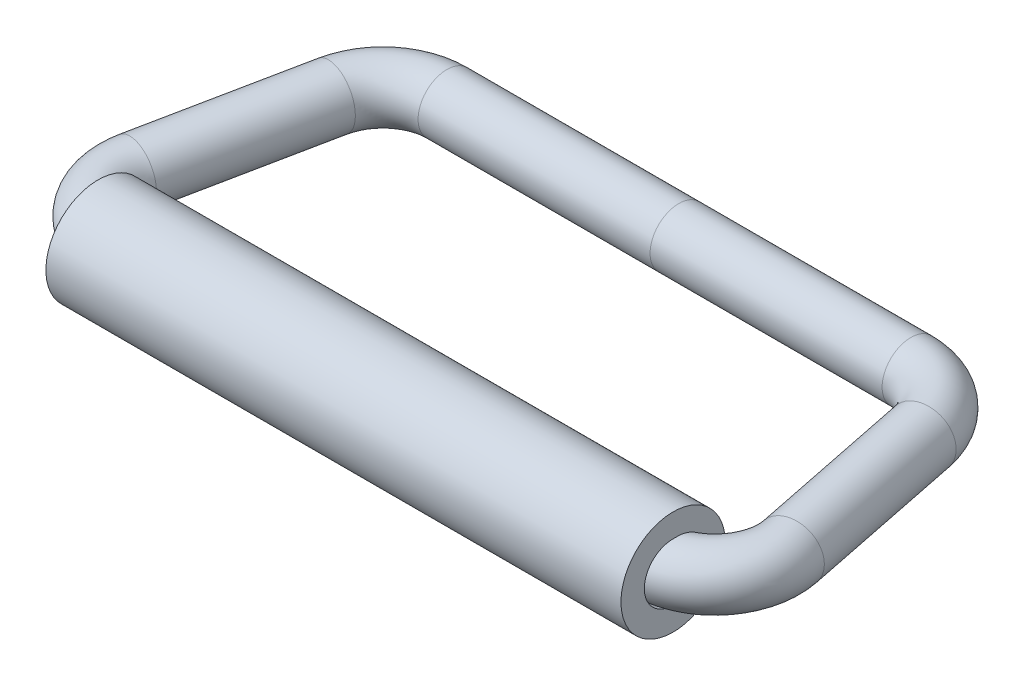
ISO-10303-21;
HEADER;
FILE_DESCRIPTION(('STEP AP214'),'2;1');
FILE_NAME('part.step','',(''),(''),'','','');
FILE_SCHEMA(('AUTOMOTIVE_DESIGN { 1 0 10303 214 1 1 1 1 }'));
ENDSEC;
DATA;
#1=APPLICATION_CONTEXT('core data for automotive mechanical design processes');
#2=APPLICATION_PROTOCOL_DEFINITION('international standard','automotive_design',2000,#1);
#3=PRODUCT_CONTEXT('',#1,'mechanical');
#4=PRODUCT('Part','Part','',(#3));
#5=PRODUCT_RELATED_PRODUCT_CATEGORY('part','',(#4));
#6=PRODUCT_DEFINITION_FORMATION('','',#4);
#7=PRODUCT_DEFINITION_CONTEXT('part definition',#1,'design');
#8=PRODUCT_DEFINITION('design','',#6,#7);
#9=PRODUCT_DEFINITION_SHAPE('','',#8);
#10=(LENGTH_UNIT() NAMED_UNIT(*) SI_UNIT(.MILLI.,.METRE.));
#11=(NAMED_UNIT(*) PLANE_ANGLE_UNIT() SI_UNIT($,.RADIAN.));
#12=(NAMED_UNIT(*) SI_UNIT($,.STERADIAN.) SOLID_ANGLE_UNIT());
#13=UNCERTAINTY_MEASURE_WITH_UNIT(LENGTH_MEASURE(1.E-05),#10,'distance_accuracy_value','');
#14=(GEOMETRIC_REPRESENTATION_CONTEXT(3) GLOBAL_UNCERTAINTY_ASSIGNED_CONTEXT((#13)) GLOBAL_UNIT_ASSIGNED_CONTEXT((#10,
#11,#12)) REPRESENTATION_CONTEXT('',''));
#15=CARTESIAN_POINT('',(0.,0.,0.));
#16=DIRECTION('',(0.,0.,1.));
#17=DIRECTION('',(1.,0.,0.));
#18=AXIS2_PLACEMENT_3D('',#15,#16,#17);
#19=CARTESIAN_POINT('',(-32.276557201779,0.,-20.4));
#20=DIRECTION('',(1.,0.,0.));
#21=DIRECTION('',(0.,0.,-1.));
#22=AXIS2_PLACEMENT_3D('',#19,#20,#21);
#23=CYLINDRICAL_SURFACE('',#22,4.);
#24=CARTESIAN_POINT('',(-32.276557201779,0.,-20.4));
#25=DIRECTION('',(1.,0.,0.));
#26=DIRECTION('',(0.,0.,-1.));
#27=AXIS2_PLACEMENT_3D('',#24,#25,#26);
#28=CIRCLE('',#27,4.);
#29=CARTESIAN_POINT('',(-32.276557201779,0.,-24.4));
#30=VERTEX_POINT('',#29);
#31=EDGE_CURVE('E98',#30,#30,#28,.T.);
#32=ORIENTED_EDGE('',*,*,#31,.T.);
#33=EDGE_LOOP('',(#32));
#34=FACE_BOUND('',#33,.T.);
#35=CARTESIAN_POINT('',(0.,0.,-20.4));
#36=DIRECTION('',(1.,0.,0.));
#37=DIRECTION('',(0.,0.,-1.));
#38=AXIS2_PLACEMENT_3D('',#35,#36,#37);
#39=CIRCLE('',#38,4.);
#40=CARTESIAN_POINT('',(0.,0.,-24.4));
#41=VERTEX_POINT('',#40);
#42=EDGE_CURVE('E95',#41,#41,#39,.T.);
#43=ORIENTED_EDGE('',*,*,#42,.F.);
#44=EDGE_LOOP('',(#43));
#45=FACE_BOUND('',#44,.T.);
#46=ADVANCED_FACE('F38',(#34,#45),#23,.T.);
#47=CARTESIAN_POINT('',(-32.276557201779,0.,-11.5));
#48=DIRECTION('',(0.,-1.,0.));
#49=DIRECTION('',(0.,0.,-1.));
#50=AXIS2_PLACEMENT_3D('',#47,#48,#49);
#51=TOROIDAL_SURFACE('',#50,8.90000000000001,4.);
#52=CARTESIAN_POINT('',(-40.9991621981761,0.,-13.2680956073778));
#53=DIRECTION('',(0.198662427795257,0.,-0.980067977123268));
#54=DIRECTION('',(-0.980067977123268,0.,-0.198662427795257));
#55=AXIS2_PLACEMENT_3D('',#52,#53,#54);
#56=CIRCLE('',#55,4.);
#57=CARTESIAN_POINT('',(-44.9194341066692,0.,-14.0627453185588));
#58=VERTEX_POINT('',#57);
#59=EDGE_CURVE('E185',#58,#58,#56,.T.);
#60=CARTESIAN_POINT('',(-32.276557201779,0.,-11.5));
#61=DIRECTION('',(0.,-1.,0.));
#62=DIRECTION('',(0.,0.,-1.));
#63=AXIS2_PLACEMENT_3D('',#60,#61,#62);
#64=CIRCLE('',#63,12.9);
#65=EDGE_CURVE('',#58,#30,#64,.T.);
#66=ORIENTED_EDGE('',*,*,#59,.T.);
#67=ORIENTED_EDGE('',*,*,#31,.F.);
#68=ORIENTED_EDGE('',*,*,#65,.T.);
#69=ORIENTED_EDGE('',*,*,#65,.F.);
#70=EDGE_LOOP('',(#66,#68,#67,#69));
#71=FACE_BOUND('',#70,.T.);
#72=ADVANCED_FACE('F206',(#71),#51,.T.);
#73=CARTESIAN_POINT('',(-45.6613243603382,0.,9.73190439262221));
#74=DIRECTION('',(0.198662427795257,0.,-0.980067977123268));
#75=DIRECTION('',(-0.980067977123268,0.,-0.198662427795257));
#76=AXIS2_PLACEMENT_3D('',#73,#74,#75);
#77=CYLINDRICAL_SURFACE('',#76,4.);
#78=CARTESIAN_POINT('',(-45.6613243603382,0.,9.73190439262221));
#79=DIRECTION('',(0.198662427795257,0.,-0.980067977123268));
#80=DIRECTION('',(-0.980067977123268,0.,-0.198662427795257));
#81=AXIS2_PLACEMENT_3D('',#78,#79,#80);
#82=CIRCLE('',#81,4.);
#83=CARTESIAN_POINT('',(-49.5815962688313,0.,8.93725468144119));
#84=VERTEX_POINT('',#83);
#85=EDGE_CURVE('E87',#84,#84,#82,.T.);
#86=CARTESIAN_POINT('',(-49.5815962688313,0.,8.93725468144119));
#87=CARTESIAN_POINT('',(-49.5330320796421,0.,8.69767134810785));
#88=CARTESIAN_POINT('',(-49.4844678904529,0.,8.45808801477452));
#89=CARTESIAN_POINT('',(-49.3873395120746,0.,7.97892134810785));
#90=CARTESIAN_POINT('',(-49.3387753228854,0.,7.73933801477452));
#91=CARTESIAN_POINT('',(-49.241646944507,0.,7.26017134810785));
#92=CARTESIAN_POINT('',(-49.1930827553178,0.,7.02058801477452));
#93=CARTESIAN_POINT('',(-49.0959543769394,0.,6.54142134810785));
#94=CARTESIAN_POINT('',(-49.0473901877502,0.,6.30183801477452));
#95=CARTESIAN_POINT('',(-48.9502618093719,0.,5.82267134810785));
#96=CARTESIAN_POINT('',(-48.9016976201827,0.,5.58308801477452));
#97=CARTESIAN_POINT('',(-48.8045692418043,0.,5.10392134810785));
#98=CARTESIAN_POINT('',(-48.7560050526151,0.,4.86433801477452));
#99=CARTESIAN_POINT('',(-48.6588766742367,0.,4.38517134810785));
#100=CARTESIAN_POINT('',(-48.6103124850475,0.,4.14558801477452));
#101=CARTESIAN_POINT('',(-48.5131841066692,0.,3.66642134810785));
#102=CARTESIAN_POINT('',(-48.46461991748,0.,3.42683801477452));
#103=CARTESIAN_POINT('',(-48.3674915391016,0.,2.94767134810785));
#104=CARTESIAN_POINT('',(-48.3189273499124,0.,2.70808801477452));
#105=CARTESIAN_POINT('',(-48.221798971534,0.,2.22892134810786));
#106=CARTESIAN_POINT('',(-48.1732347823448,0.,1.98933801477452));
#107=CARTESIAN_POINT('',(-48.0761064039665,0.,1.51017134810786));
#108=CARTESIAN_POINT('',(-48.0275422147773,0.,1.27058801477452));
#109=CARTESIAN_POINT('',(-47.9304138363989,0.,0.791421348107857));
#110=CARTESIAN_POINT('',(-47.8818496472097,0.,0.551838014774523));
#111=CARTESIAN_POINT('',(-47.7847212688313,0.,0.0726713481078568));
#112=CARTESIAN_POINT('',(-47.7361570796421,0.,-0.166911985225476));
#113=CARTESIAN_POINT('',(-47.6390287012638,0.,-0.646078651892143));
#114=CARTESIAN_POINT('',(-47.5904645120746,0.,-0.885661985225477));
#115=CARTESIAN_POINT('',(-47.4933361336962,0.,-1.36482865189214));
#116=CARTESIAN_POINT('',(-47.444771944507,0.,-1.60441198522548));
#117=CARTESIAN_POINT('',(-47.3476435661286,0.,-2.08357865189214));
#118=CARTESIAN_POINT('',(-47.2990793769394,0.,-2.32316198522548));
#119=CARTESIAN_POINT('',(-47.2019509985611,0.,-2.80232865189214));
#120=CARTESIAN_POINT('',(-47.1533868093719,0.,-3.04191198522548));
#121=CARTESIAN_POINT('',(-47.0562584309935,0.,-3.52107865189214));
#122=CARTESIAN_POINT('',(-47.0076942418043,0.,-3.76066198522547));
#123=CARTESIAN_POINT('',(-46.9105658634259,0.,-4.23982865189214));
#124=CARTESIAN_POINT('',(-46.8620016742367,0.,-4.47941198522547));
#125=CARTESIAN_POINT('',(-46.7648732958584,0.,-4.95857865189214));
#126=CARTESIAN_POINT('',(-46.7163091066692,0.,-5.19816198522547));
#127=CARTESIAN_POINT('',(-46.6191807282908,0.,-5.67732865189214));
#128=CARTESIAN_POINT('',(-46.5706165391016,0.,-5.91691198522547));
#129=CARTESIAN_POINT('',(-46.4734881607232,0.,-6.39607865189214));
#130=CARTESIAN_POINT('',(-46.424923971534,0.,-6.63566198522547));
#131=CARTESIAN_POINT('',(-46.3277955931556,0.,-7.11482865189214));
#132=CARTESIAN_POINT('',(-46.2792314039665,0.,-7.35441198522547));
#133=CARTESIAN_POINT('',(-46.1821030255881,0.,-7.83357865189214));
#134=CARTESIAN_POINT('',(-46.1335388363989,0.,-8.07316198522548));
#135=CARTESIAN_POINT('',(-46.0364104580205,0.,-8.55232865189214));
#136=CARTESIAN_POINT('',(-45.9878462688313,0.,-8.79191198522548));
#137=CARTESIAN_POINT('',(-45.8907178904529,0.,-9.27107865189214));
#138=CARTESIAN_POINT('',(-45.8421537012638,0.,-9.51066198522547));
#139=CARTESIAN_POINT('',(-45.7450253228854,0.,-9.98982865189214));
#140=CARTESIAN_POINT('',(-45.6964611336962,0.,-10.2294119852255));
#141=CARTESIAN_POINT('',(-45.5993327553178,0.,-10.7085786518921));
#142=CARTESIAN_POINT('',(-45.5507685661286,0.,-10.9481619852255));
#143=CARTESIAN_POINT('',(-45.4536401877502,0.,-11.4273286518921));
#144=CARTESIAN_POINT('',(-45.4050759985611,0.,-11.6669119852255));
#145=CARTESIAN_POINT('',(-45.3079476201827,0.,-12.1460786518921));
#146=CARTESIAN_POINT('',(-45.2593834309935,0.,-12.3856619852255));
#147=CARTESIAN_POINT('',(-45.1622550526151,0.,-12.8648286518921));
#148=CARTESIAN_POINT('',(-45.1136908634259,0.,-13.1044119852255));
#149=CARTESIAN_POINT('',(-45.0165624850475,0.,-13.5835786518921));
#150=CARTESIAN_POINT('',(-44.9679982958583,0.,-13.8231619852255));
#151=CARTESIAN_POINT('',(-44.9194341066692,0.,-14.0627453185588));
#152=B_SPLINE_CURVE_WITH_KNOTS('',3,(#86,#87,#88,#89,#90,#91,#92,#93,#94,#95,#96,#97,#98,#99,
#100,#101,#102,#103,#104,#105,#106,#107,#108,#109,#110,#111,#112,#113,#114,#115,#116,#117,#118,
#119,#120,#121,#122,#123,#124,#125,#126,#127,#128,#129,#130,#131,#132,#133,#134,#135,#136,#137,
#138,#139,#140,#141,#142,#143,#144,#145,#146,#147,#148,#149,#150,#151),.UNSPECIFIED.,.F.,.F.,(4,
2,2,2,2,2,2,2,2,2,2,2,2,2,2,2,2,2,2,2,2,2,2,2,2,2,2,2,2,2,2,2,4),(0.,0.733367497742045,
1.46673499548409,2.20010249322614,2.93346999096818,3.66683748871023,4.40020498645227,
5.13357248419432,5.86693998193637,6.60030747967841,7.33367497742046,8.0670424751625,
8.80040997290455,9.53377747064659,10.2671449683886,11.0005124661307,11.7338799638727,
12.4672474616148,13.2006149593568,13.9339824570989,14.6673499548409,15.400717452583,
16.134084950325,16.8674524480671,17.6008199458091,18.3341874435511,19.0675549412932,
19.8009224390352,20.5342899367773,21.2676574345193,22.0010249322614,22.7343924300034,
23.4677599277455),.UNSPECIFIED.);
#153=EDGE_CURVE('BSEAM201',#84,#58,#152,.T.);
#154=ORIENTED_EDGE('',*,*,#85,.T.);
#155=ORIENTED_EDGE('',*,*,#59,.F.);
#156=ORIENTED_EDGE('',*,*,#153,.T.);
#157=ORIENTED_EDGE('',*,*,#153,.F.);
#158=EDGE_LOOP('',(#154,#156,#155,#157));
#159=FACE_BOUND('',#158,.T.);
#160=ADVANCED_FACE('F201',(#159),#77,.T.);
#161=CARTESIAN_POINT('',(-36.9387193639412,0.,11.5));
#162=DIRECTION('',(0.,-1.,0.));
#163=DIRECTION('',(0.,0.,-1.));
#164=AXIS2_PLACEMENT_3D('',#161,#162,#163);
#165=TOROIDAL_SURFACE('',#164,8.90000000000001,4.);
#166=CARTESIAN_POINT('',(-36.9387193639412,-4.,20.4));
#167=CARTESIAN_POINT('',(-36.9831922499245,-3.99999999247136,20.3999999992754));
#168=CARTESIAN_POINT('',(-37.027664744402,-4.00000001330925,20.3998333248389));
#169=CARTESIAN_POINT('',(-37.0955952576285,-3.99999994524433,20.3993241661978));
#170=CARTESIAN_POINT('',(-37.1190541672044,-3.99999990354046,20.3991019582468));
#171=CARTESIAN_POINT('',(-37.2363491274586,-3.99999953520248,20.3977590334732));
#172=CARTESIAN_POINT('',(-37.3301781699126,-3.9999987291083,20.3959427125296));
#173=CARTESIAN_POINT('',(-37.5300905305368,-3.99998978193892,20.3904926285188));
#174=CARTESIAN_POINT('',(-37.636168254539,-3.99998069340793,20.3866518738413));
#175=CARTESIAN_POINT('',(-37.8186580759454,-3.99994317332606,20.378414451407));
#176=CARTESIAN_POINT('',(-37.8950912013211,-3.99992084468574,20.3744717131444));
#177=CARTESIAN_POINT('',(-38.1243563707546,-3.99982165077624,20.3611692811104));
#178=CARTESIAN_POINT('',(-38.2771063078849,-3.99971257134259,20.350336916988));
#179=CARTESIAN_POINT('',(-38.5822966906194,-3.99931253723268,20.3247738850601));
#180=CARTESIAN_POINT('',(-38.7347370857072,-3.99902155494227,20.3100426255707));
#181=CARTESIAN_POINT('',(-39.1930961723671,-3.99768834987619,20.2598722939142));
#182=CARTESIAN_POINT('',(-39.4983918030982,-3.99618406620174,20.2185534088906));
#183=CARTESIAN_POINT('',(-40.1065659762804,-3.99053750243707,20.1207095912008));
#184=CARTESIAN_POINT('',(-40.4094439463607,-3.98639461538799,20.0641811616063));
#185=CARTESIAN_POINT('',(-41.0124480286136,-3.97356305342206,19.936397846454));
#186=CARTESIAN_POINT('',(-41.3125694949233,-3.96486777226947,19.8651216507325));
#187=CARTESIAN_POINT('',(-41.9088474888836,-3.9405910326798,19.7086152927992));
#188=CARTESIAN_POINT('',(-42.2050044044255,-3.92501025306862,19.6233865066635));
#189=CARTESIAN_POINT('',(-42.7937045133858,-3.8841144507554,19.4394976306619));
#190=CARTESIAN_POINT('',(-43.0862296134978,-3.8587625242126,19.3407875481625));
#191=CARTESIAN_POINT('',(-43.6656027085005,-3.79503723391384,19.1312628671953));
#192=CARTESIAN_POINT('',(-43.9524492281338,-3.75666053219807,19.0204451707572));
#193=CARTESIAN_POINT('',(-44.5189275174066,-3.66303737439471,18.7882201824454));
#194=CARTESIAN_POINT('',(-44.7985622739206,-3.60779802801683,18.6668173689012));
#195=CARTESIAN_POINT('',(-45.3486983190046,-3.47584439062153,18.415386236101));
#196=CARTESIAN_POINT('',(-45.6192058789706,-3.39914519608993,18.2853640292688));
#197=CARTESIAN_POINT('',(-46.0420182107173,-3.25481251701686,18.072896222911));
#198=CARTESIAN_POINT('',(-46.1982217266323,-3.19587841748618,17.9922816481005));
#199=CARTESIAN_POINT('',(-46.5053799019761,-3.0667728662095,17.829847430808));
#200=CARTESIAN_POINT('',(-46.6563333419962,-2.99659882475543,17.7480275145671));
#201=CARTESIAN_POINT('',(-46.9511176555876,-2.84363930805467,17.584649677934));
#202=CARTESIAN_POINT('',(-47.0949710401639,-2.76089760729247,17.5030918144958));
#203=CARTESIAN_POINT('',(-47.3741425758596,-2.58086705108109,17.3416121941559));
#204=CARTESIAN_POINT('',(-47.5094683433962,-2.48359144607047,17.261689021604));
#205=CARTESIAN_POINT('',(-47.7697022692695,-2.27200455567076,17.1052473912267));
#206=CARTESIAN_POINT('',(-47.8945597868682,-2.15761716350388,17.0287462352369));
#207=CARTESIAN_POINT('',(-48.1293234434825,-1.91028545420131,16.8827003368032));
#208=CARTESIAN_POINT('',(-48.2392370498072,-1.77735047288119,16.8131521246822));
#209=CARTESIAN_POINT('',(-48.4237284198087,-1.51345803896383,16.6949937459766));
#210=CARTESIAN_POINT('',(-48.501134617391,-1.38521330803677,16.6448076880231));
#211=CARTESIAN_POINT('',(-48.6370149997347,-1.11531969294358,16.5560255827996));
#212=CARTESIAN_POINT('',(-48.6955167113242,-0.973690689840357,16.5174126898368));
#213=CARTESIAN_POINT('',(-48.7809424914812,-0.705534550883099,16.4607656010287));
#214=CARTESIAN_POINT('',(-48.8116069276033,-0.580720370040205,16.4403089025005));
#215=CARTESIAN_POINT('',(-48.8549960071317,-0.326653524945449,16.4113156244848));
#216=CARTESIAN_POINT('',(-48.8677315976849,-0.197403618531129,16.4027717711817));
#217=CARTESIAN_POINT('',(-48.874292626146,0.0620277336429457,16.3983737220279));
#218=CARTESIAN_POINT('',(-48.8680846975278,0.192210419683351,16.4025419167767));
#219=CARTESIAN_POINT('',(-48.837182669585,0.449351570982231,16.4232246890043));
#220=CARTESIAN_POINT('',(-48.8124818444967,0.576308845803015,16.4397437584249));
#221=CARTESIAN_POINT('',(-48.7468979208159,0.821782565679297,16.4833695789292));
#222=CARTESIAN_POINT('',(-48.7062733577562,0.940399812724233,16.5103070891314));
#223=CARTESIAN_POINT('',(-48.6111864064683,1.16941983067327,16.5729150150316));
#224=CARTESIAN_POINT('',(-48.5567185428537,1.27981932885324,16.6085888859841));
#225=CARTESIAN_POINT('',(-48.4026224578904,1.55075603612211,16.708642466734));
#226=CARTESIAN_POINT('',(-48.294773153411,1.70480672304907,16.7779189295564));
#227=CARTESIAN_POINT('',(-48.0588471213419,1.99087165368545,16.9268740926012));
#228=CARTESIAN_POINT('',(-47.9307171795984,2.12282599005119,17.0065800605684));
#229=CARTESIAN_POINT('',(-47.6874288727473,2.34168870255373,17.1549701466197));
#230=CARTESIAN_POINT('',(-47.5749046373645,2.43230647493424,17.2226140616665));
#231=CARTESIAN_POINT('',(-47.3425200786475,2.60193281146479,17.3599560175854));
#232=CARTESIAN_POINT('',(-47.2226552207322,2.68093409508245,17.4296553140781));
#233=CARTESIAN_POINT('',(-46.9769639642569,2.82859821303481,17.5699090329707));
#234=CARTESIAN_POINT('',(-46.8511293148198,2.89724615638248,17.6404645322845));
#235=CARTESIAN_POINT('',(-46.5947033842309,3.02523985711899,17.7814168921933));
#236=CARTESIAN_POINT('',(-46.4641103395076,3.08458212148931,17.8518136834888));
#237=CARTESIAN_POINT('',(-46.0888327688653,3.24090052744337,18.0498374041879));
#238=CARTESIAN_POINT('',(-45.8395259952141,3.32816782206536,18.1764062173371));
#239=CARTESIAN_POINT('',(-45.3311961476864,3.48049705860007,18.4233458752716));
#240=CARTESIAN_POINT('',(-45.072164736822,3.54553944112612,18.5437111818729));
#241=CARTESIAN_POINT('',(-44.5463488666153,3.65786728064673,18.7762124393158));
#242=CARTESIAN_POINT('',(-44.279555651429,3.7051317743366,18.8883385501514));
#243=CARTESIAN_POINT('',(-43.7400926606824,3.78549016766408,19.1026433045254));
#244=CARTESIAN_POINT('',(-43.4674250643057,3.81858923023408,19.2048255618314));
#245=CARTESIAN_POINT('',(-42.7973497216741,3.88583669233427,19.4402331651257));
#246=CARTESIAN_POINT('',(-42.3972992248877,3.91417254127745,19.567614634214));
#247=CARTESIAN_POINT('',(-41.5899015867099,3.95598326106469,19.7968897316942));
#248=CARTESIAN_POINT('',(-41.1825660876088,3.96948000655375,19.8988207053021));
#249=CARTESIAN_POINT('',(-40.52018738937,3.98426984029531,20.0414800051765));
#250=CARTESIAN_POINT('',(-40.2669896067089,3.98826190420865,20.090651828283));
#251=CARTESIAN_POINT('',(-39.7587277704725,3.9941015647225,20.1784306115846));
#252=CARTESIAN_POINT('',(-39.5036636245663,3.99594905449696,20.2170370454208));
#253=CARTESIAN_POINT('',(-38.9292521434738,3.99874639754893,20.291552312834));
#254=CARTESIAN_POINT('',(-38.6095078827596,3.99936418270501,20.3244678699363));
#255=CARTESIAN_POINT('',(-38.0944184581311,3.99985905656119,20.3635478515603));
#256=CARTESIAN_POINT('',(-37.8994690547797,3.99993162173623,20.3751409845767));
#257=CARTESIAN_POINT('',(-37.5898869806895,3.99998633972357,20.3884575789015));
#258=CARTESIAN_POINT('',(-37.4753431014971,3.9999934582188,20.3922798119053));
#259=CARTESIAN_POINT('',(-37.2645747077106,3.99999973553033,20.3972773140481));
#260=CARTESIAN_POINT('',(-37.1683579336307,3.99999998767554,20.398778752631));
#261=CARTESIAN_POINT('',(-37.0276644530507,3.99999996000337,20.3998333438879));
#262=CARTESIAN_POINT('',(-36.9831918003792,3.99999989335383,20.4000000330881));
#263=CARTESIAN_POINT('',(-36.9387193639412,4.,20.4));
#264=B_SPLINE_CURVE_WITH_KNOTS('',3,(#166,#167,#168,#169,#170,#171,#172,#173,#174,#175,#176,
#177,#178,#179,#180,#181,#182,#183,#184,#185,#186,#187,#188,#189,#190,#191,#192,#193,#194,#195,
#196,#197,#198,#199,#200,#201,#202,#203,#204,#205,#206,#207,#208,#209,#210,#211,#212,#213,#214,
#215,#216,#217,#218,#219,#220,#221,#222,#223,#224,#225,#226,#227,#228,#229,#230,#231,#232,#233,
#234,#235,#236,#237,#238,#239,#240,#241,#242,#243,#244,#245,#246,#247,#248,#249,#250,#251,#252,
#253,#254,#255,#256,#257,#258,#259,#260,#261,#262,#263),.UNSPECIFIED.,.F.,.F.,(4,2,2,2,2,2,2,2,
2,2,2,2,2,2,2,2,2,2,2,2,2,2,2,2,2,2,2,2,2,2,2,2,2,2,2,2,2,2,2,2,2,2,2,2,2,2,2,2,4),(0.,
0.133417577552538,0.203797339670864,0.485324633575552,0.803748073655118,1.03334770770579,
1.49269071037221,1.95210346146922,2.87591448142538,3.79993808273862,4.72530631876285,
5.65058334514623,6.57938977119425,7.50843440961013,8.43708787949222,9.36508969952137,
9.92093753178114,10.4769136173508,11.0309957993233,11.5845758773147,12.1406955990519,
12.6965364044398,13.1687329722709,13.640238843464,14.0289801234135,14.4174839393065,
14.8066724485006,15.1960025721993,15.5792572886967,15.9626638289771,16.560477030215,
17.1598856559453,17.6378102081551,18.1160330302163,18.5949372416989,19.0740207885742,
19.9512474687322,20.8292441896816,21.7082730037742,22.5869811612383,23.8481123312104,
25.1073819373219,25.8810484947424,26.6547535885707,27.6185531670354,28.2043371660391,
28.5481395678454,28.8368116793159,28.9702292568685),.UNSPECIFIED.);
#265=CARTESIAN_POINT('',(-36.9387193639412,-4.,20.4));
#266=VERTEX_POINT('',#265);
#267=CARTESIAN_POINT('',(-40.,-3.99132851260049,20.1367573277329));
#268=VERTEX_POINT('',#267);
#269=EDGE_CURVE('E125',#266,#268,#264,.T.);
#270=ORIENTED_EDGE('',*,*,#269,.F.);
#271=CARTESIAN_POINT('',(-36.9387193639412,0.,20.4));
#272=DIRECTION('',(-1.,0.,0.));
#273=DIRECTION('',(0.,0.,1.));
#274=AXIS2_PLACEMENT_3D('',#271,#272,#273);
#275=CIRCLE('',#274,4.);
#276=CARTESIAN_POINT('',(-36.9387193639412,4.,20.4));
#277=VERTEX_POINT('',#276);
#278=EDGE_CURVE('E124',#277,#266,#275,.F.);
#279=ORIENTED_EDGE('',*,*,#278,.F.);
#280=CARTESIAN_POINT('',(-40.0000000000006,3.99132851260048,20.1367573277328));
#281=VERTEX_POINT('',#280);
#282=EDGE_CURVE('E61',#281,#277,#264,.T.);
#283=ORIENTED_EDGE('',*,*,#282,.F.);
#284=CARTESIAN_POINT('',(-40.,-1.35765464125862,15.6257684314362));
#285=CARTESIAN_POINT('',(-40.,-1.57859161883641,15.7250512514339));
#286=CARTESIAN_POINT('',(-40.,-1.79006031312808,15.8462406448333));
#287=CARTESIAN_POINT('',(-40.,-2.08907968246985,16.0537283022921));
#288=CARTESIAN_POINT('',(-40.,-2.18590826902038,16.1273585945529));
#289=CARTESIAN_POINT('',(-40.,-2.37319419407116,16.2823309232298));
#290=CARTESIAN_POINT('',(-40.,-2.46365262510079,16.3636716316101));
#291=CARTESIAN_POINT('',(-40.,-2.72366687316132,16.6167814792497));
#292=CARTESIAN_POINT('',(-40.,-2.88344378862355,16.7987568000463));
#293=CARTESIAN_POINT('',(-40.,-3.1738807688161,17.184191329438));
#294=CARTESIAN_POINT('',(-40.,-3.30456237988398,17.3876344745012));
#295=CARTESIAN_POINT('',(-40.,-3.54801205695302,17.8365086696348));
#296=CARTESIAN_POINT('',(-40.,-3.65689107173955,18.0840668757323));
#297=CARTESIAN_POINT('',(-40.,-3.83180281335409,18.5940111182931));
#298=CARTESIAN_POINT('',(-40.,-3.89781932214729,18.8564027265486));
#299=CARTESIAN_POINT('',(-40.,-3.98391610231153,19.389678378228));
#300=CARTESIAN_POINT('',(-40.,-4.00383112058053,19.6605894552803));
#301=CARTESIAN_POINT('',(-40.,-3.99495498487068,20.2016416401596));
#302=CARTESIAN_POINT('',(-40.,-3.96618037434459,20.4717829782861));
#303=CARTESIAN_POINT('',(-40.,-3.86233402483068,20.9869091450466));
#304=CARTESIAN_POINT('',(-40.,-3.79001453787958,21.2324479074623));
#305=CARTESIAN_POINT('',(-40.,-3.6025064784742,21.7065947437606));
#306=CARTESIAN_POINT('',(-40.,-3.48733374539111,21.9352090358613));
#307=CARTESIAN_POINT('',(-40.,-3.2251956233097,22.3541525173041));
#308=CARTESIAN_POINT('',(-40.,-3.08060258764187,22.5459674292354));
#309=CARTESIAN_POINT('',(-40.,-2.75986092126741,22.901111447721));
#310=CARTESIAN_POINT('',(-40.,-2.58372124391688,23.0644486107488));
#311=CARTESIAN_POINT('',(-40.,-2.2136733202585,23.3502735755767));
#312=CARTESIAN_POINT('',(-40.,-2.0209384803157,23.4742820923585));
#313=CARTESIAN_POINT('',(-40.,-1.61691545589556,23.6870764353297));
#314=CARTESIAN_POINT('',(-40.,-1.40563065595072,23.7758686706603));
#315=CARTESIAN_POINT('',(-40.,-0.977000654330475,23.9132587710987));
#316=CARTESIAN_POINT('',(-40.,-0.759997674140867,23.9629259408876));
#317=CARTESIAN_POINT('',(-40.,-0.320707794210489,24.0245853932418));
#318=CARTESIAN_POINT('',(-40.,-0.0984213928426613,24.0365812151599));
#319=CARTESIAN_POINT('',(-40.,0.34201483545203,24.0226062268014));
#320=CARTESIAN_POINT('',(-40.,0.560180631920564,23.9971323408911));
#321=CARTESIAN_POINT('',(-40.,0.989132963411646,23.9099349698535));
#322=CARTESIAN_POINT('',(-40.,1.19991967009673,23.8482123285891));
#323=CARTESIAN_POINT('',(-40.,1.60836410739102,23.6904047747075));
#324=CARTESIAN_POINT('',(-40.,1.80601261955206,23.5942960305695));
#325=CARTESIAN_POINT('',(-40.,2.18266352290377,23.3707002990479));
#326=CARTESIAN_POINT('',(-40.,2.36166514799682,23.2432120231756));
#327=CARTESIAN_POINT('',(-40.,2.69877071985095,22.9586927858475));
#328=CARTESIAN_POINT('',(-40.,2.85654306640644,22.8012692635731));
#329=CARTESIAN_POINT('',(-40.,3.14427215722648,22.4628058477792));
#330=CARTESIAN_POINT('',(-40.,3.27422610237186,22.2817635806618));
#331=CARTESIAN_POINT('',(-40.,3.50668457579782,21.8958764254583));
#332=CARTESIAN_POINT('',(-40.,3.60831536094659,21.6905057143226));
#333=CARTESIAN_POINT('',(-40.,3.77722886875311,21.2661234401737));
#334=CARTESIAN_POINT('',(-40.,3.84450595569671,21.0471096456245));
#335=CARTESIAN_POINT('',(-40.,3.9460366189659,20.5917249912908));
#336=CARTESIAN_POINT('',(-40.,3.97875443292964,20.3550124157341));
#337=CARTESIAN_POINT('',(-40.,4.00624666715339,19.8794168709446));
#338=CARTESIAN_POINT('',(-40.,4.00101135008652,19.6405333604342));
#339=CARTESIAN_POINT('',(-40.,3.95250684360939,19.1530230759277));
#340=CARTESIAN_POINT('',(-40.,3.90710365240461,18.9046092134992));
#341=CARTESIAN_POINT('',(-40.,3.77767100876292,18.4180857498352));
#342=CARTESIAN_POINT('',(-40.,3.6936340711904,18.179978155184));
#343=CARTESIAN_POINT('',(-40.,3.48367308282866,17.7058251131842));
#344=CARTESIAN_POINT('',(-40.,3.35554104098402,17.4707579807863));
#345=CARTESIAN_POINT('',(-40.,3.06233129128753,17.0243194333348));
#346=CARTESIAN_POINT('',(-40.,2.8972100941228,16.8129763540788));
#347=CARTESIAN_POINT('',(-40.,2.62251507159586,16.5170185112972));
#348=CARTESIAN_POINT('',(-40.,2.52514311886624,16.4208801500253));
#349=CARTESIAN_POINT('',(-40.,2.32211897600598,16.2377922674857));
#350=CARTESIAN_POINT('',(-40.,2.21646548040585,16.1508442000332));
#351=CARTESIAN_POINT('',(-40.,1.8881687224954,15.9060124364595));
#352=CARTESIAN_POINT('',(-40.,1.65353653853314,15.7634273385638));
#353=CARTESIAN_POINT('',(-40.,1.23639482727613,15.5687587641137));
#354=CARTESIAN_POINT('',(-40.,1.06055085927529,15.5023172885722));
#355=CARTESIAN_POINT('',(-40.,0.790471821623691,15.4252070328354));
#356=CARTESIAN_POINT('',(-40.,0.699399821624738,15.4032630130072));
#357=CARTESIAN_POINT('',(-40.,0.515714123624887,15.367330775505));
#358=CARTESIAN_POINT('',(-40.,0.423100999495509,15.3533396617316));
#359=CARTESIAN_POINT('',(-40.,0.236549012639153,15.3335933237267));
#360=CARTESIAN_POINT('',(-40.,0.142605920848659,15.3278779411782));
#361=CARTESIAN_POINT('',(-40.,-0.0454195488323126,15.3249525551012));
#362=CARTESIAN_POINT('',(-40.,-0.139501934883417,15.3277430713363));
#363=CARTESIAN_POINT('',(-40.,-0.326991805770151,15.341757295));
#364=CARTESIAN_POINT('',(-40.,-0.420399570428456,15.3529772758862));
#365=CARTESIAN_POINT('',(-40.,-0.605835271122959,15.3835647231852));
#366=CARTESIAN_POINT('',(-40.,-0.697863559955128,15.4029300683197));
#367=CARTESIAN_POINT('',(-40.,-0.88639763418046,15.4510275357242));
#368=CARTESIAN_POINT('',(-40.,-0.982759427247476,15.4803255175167));
#369=CARTESIAN_POINT('',(-40.,-1.17250914061887,15.5470815497149));
#370=CARTESIAN_POINT('',(-40.,-1.26589842706405,15.5845357876415));
#371=CARTESIAN_POINT('',(-40.,-1.35765464125862,15.6257684314362));
#372=B_SPLINE_CURVE_WITH_KNOTS('',3,(#284,#285,#286,#287,#288,#289,#290,#291,#292,#293,#294,
#295,#296,#297,#298,#299,#300,#301,#302,#303,#304,#305,#306,#307,#308,#309,#310,#311,#312,#313,
#314,#315,#316,#317,#318,#319,#320,#321,#322,#323,#324,#325,#326,#327,#328,#329,#330,#331,#332,
#333,#334,#335,#336,#337,#338,#339,#340,#341,#342,#343,#344,#345,#346,#347,#348,#349,#350,#351,
#352,#353,#354,#355,#356,#357,#358,#359,#360,#361,#362,#363,#364,#365,#366,#367,#368,#369,#370,
#371),.UNSPECIFIED.,.T.,.F.,(4,2,2,2,2,2,2,2,2,2,2,2,2,2,2,2,2,2,2,2,2,2,2,2,2,2,2,2,2,2,2,2,2,
2,2,2,2,2,2,2,2,2,2,4),(0.,0.726186427630068,1.09083104414453,1.45541296829046,2.17883123987792,
2.90171199360023,3.70923337129141,4.51706011585529,5.32777810170221,6.13822068225112,
6.90214399875031,7.66578523476863,8.38277035454094,9.09955230594463,9.78371467029611,
10.4677524642093,11.1323752440777,11.7969355784793,12.4527615777124,13.1085723100668,
13.7648384397218,14.4211315211032,15.0867126132455,15.7523606454666,16.4367095868817,
17.1211707595016,17.8349112549378,18.5488348754609,19.3031295104765,20.0575703487254,
20.857213535234,21.6578018683901,22.067806456138,22.4778758058626,23.2951545895632,
23.8566831668944,24.137408568486,24.4180316766113,24.7000013417564,24.9819882373559,
25.263850543997,25.5456394912965,25.8473690246952,26.1489578222307),.UNSPECIFIED.);
#373=EDGE_CURVE('E11',#281,#268,#372,.T.);
#374=ORIENTED_EDGE('',*,*,#373,.T.);
#375=EDGE_LOOP('',(#270,#279,#283,#374));
#376=FACE_BOUND('',#375,.T.);
#377=ORIENTED_EDGE('',*,*,#85,.F.);
#378=EDGE_LOOP('',(#377));
#379=FACE_BOUND('',#378,.T.);
#380=ADVANCED_FACE('F127',(#376,#379),#165,.T.);
#381=CARTESIAN_POINT('',(36.9387193639412,0.,11.5));
#382=DIRECTION('',(0.,-1.,0.));
#383=DIRECTION('',(0.,0.,-1.));
#384=AXIS2_PLACEMENT_3D('',#381,#382,#383);
#385=TOROIDAL_SURFACE('',#384,8.9,4.);
#386=CARTESIAN_POINT('',(36.9387193639412,-4.,20.4));
#387=CARTESIAN_POINT('',(36.9831922499245,-3.99999999247136,20.3999999992754));
#388=CARTESIAN_POINT('',(37.027664744402,-4.00000001330925,20.3998333248389));
#389=CARTESIAN_POINT('',(37.0955952576285,-3.99999994524433,20.3993241661978));
#390=CARTESIAN_POINT('',(37.1190541672044,-3.99999990354046,20.3991019582468));
#391=CARTESIAN_POINT('',(37.2363491274587,-3.99999953520248,20.3977590334732));
#392=CARTESIAN_POINT('',(37.3301781699127,-3.9999987291083,20.3959427125296));
#393=CARTESIAN_POINT('',(37.5300905305368,-3.99998978193892,20.3904926285188));
#394=CARTESIAN_POINT('',(37.636168254539,-3.99998069340793,20.3866518738413));
#395=CARTESIAN_POINT('',(37.8186580759454,-3.99994317332606,20.378414451407));
#396=CARTESIAN_POINT('',(37.895091201321,-3.99992084468574,20.3744717131444));
#397=CARTESIAN_POINT('',(38.1243563707545,-3.99982165077624,20.3611692811104));
#398=CARTESIAN_POINT('',(38.2771063078848,-3.99971257134259,20.350336916988));
#399=CARTESIAN_POINT('',(38.5822966906191,-3.99931253723268,20.3247738850601));
#400=CARTESIAN_POINT('',(38.7347370857068,-3.99902155494227,20.3100426255707));
#401=CARTESIAN_POINT('',(39.1930961723665,-3.99768834987619,20.2598722939142));
#402=CARTESIAN_POINT('',(39.4983918030976,-3.99618406620175,20.2185534088906));
#403=CARTESIAN_POINT('',(40.1065659762795,-3.99053750243708,20.120709591201));
#404=CARTESIAN_POINT('',(40.4094439463597,-3.986394615388,20.0641811616064));
#405=CARTESIAN_POINT('',(41.0124480286124,-3.97356305342209,19.9363978464543));
#406=CARTESIAN_POINT('',(41.3125694949221,-3.96486777226951,19.8651216507328));
#407=CARTESIAN_POINT('',(41.9088474888821,-3.94059103267987,19.7086152927996));
#408=CARTESIAN_POINT('',(42.2050044044239,-3.92501025306871,19.623386506664));
#409=CARTESIAN_POINT('',(42.793704513384,-3.88411445075554,19.4394976306625));
#410=CARTESIAN_POINT('',(43.0862296134959,-3.85876252421277,19.3407875481631));
#411=CARTESIAN_POINT('',(43.6656027084984,-3.7950372339141,19.1312628671961));
#412=CARTESIAN_POINT('',(43.9524492281316,-3.75666053219838,19.0204451707581));
#413=CARTESIAN_POINT('',(44.5189275174042,-3.66303737439515,18.7882201824464));
#414=CARTESIAN_POINT('',(44.7985622739182,-3.60779802801734,18.6668173689023));
#415=CARTESIAN_POINT('',(45.348698319002,-3.47584439062222,18.4153862361022));
#416=CARTESIAN_POINT('',(45.619205878968,-3.39914519609073,18.2853640292701));
#417=CARTESIAN_POINT('',(46.0420182107147,-3.25481251701782,18.0728962229123));
#418=CARTESIAN_POINT('',(46.1982217266298,-3.19587841748718,17.9922816481018));
#419=CARTESIAN_POINT('',(46.5053799019738,-3.06677286621056,17.8298474308093));
#420=CARTESIAN_POINT('',(46.656333341994,-2.99659882475653,17.7480275145684));
#421=CARTESIAN_POINT('',(46.9511176555855,-2.84363930805583,17.5846496779352));
#422=CARTESIAN_POINT('',(47.0949710401619,-2.76089760729366,17.5030918144969));
#423=CARTESIAN_POINT('',(47.3741425758577,-2.58086705108233,17.341612194157));
#424=CARTESIAN_POINT('',(47.5094683433945,-2.48359144607174,17.261689021605));
#425=CARTESIAN_POINT('',(47.769702269268,-2.27200455567206,17.1052473912276));
#426=CARTESIAN_POINT('',(47.8945597868668,-2.15761716350519,17.0287462352377));
#427=CARTESIAN_POINT('',(48.1293234434813,-1.91028545420261,16.8827003368039));
#428=CARTESIAN_POINT('',(48.2392370498062,-1.77735047288247,16.8131521246828));
#429=CARTESIAN_POINT('',(48.4237284198079,-1.51345803896508,16.6949937459771));
#430=CARTESIAN_POINT('',(48.5011346173903,-1.38521330803802,16.6448076880236));
#431=CARTESIAN_POINT('',(48.6370149997341,-1.1153196929448,16.5560255827999));
#432=CARTESIAN_POINT('',(48.6955167113238,-0.973690689841561,16.5174126898371));
#433=CARTESIAN_POINT('',(48.7809424914808,-0.705534550884281,16.4607656010289));
#434=CARTESIAN_POINT('',(48.8116069276031,-0.580720370041389,16.4403089025006));
#435=CARTESIAN_POINT('',(48.8549960071316,-0.326653524946626,16.4113156244849));
#436=CARTESIAN_POINT('',(48.8677315976848,-0.197403618532298,16.4027717711817));
#437=CARTESIAN_POINT('',(48.874292626146,0.0620277336418092,16.3983737220279));
#438=CARTESIAN_POINT('',(48.8680846975278,0.192210419682238,16.4025419167766));
#439=CARTESIAN_POINT('',(48.8371826695852,0.449351570981174,16.4232246890042));
#440=CARTESIAN_POINT('',(48.8124818444969,0.57630884580199,16.4397437584247));
#441=CARTESIAN_POINT('',(48.7468979208162,0.821782565678311,16.483369578929));
#442=CARTESIAN_POINT('',(48.7062733577566,0.940399812723257,16.5103070891312));
#443=CARTESIAN_POINT('',(48.6111864064687,1.16941983067231,16.5729150150313));
#444=CARTESIAN_POINT('',(48.5567185428541,1.2798193288523,16.6085888859838));
#445=CARTESIAN_POINT('',(48.402622457891,1.55075603612115,16.7086424667336));
#446=CARTESIAN_POINT('',(48.2947731534117,1.70480672304809,16.7779189295559));
#447=CARTESIAN_POINT('',(48.0588471213428,1.99087165368444,16.9268740926006));
#448=CARTESIAN_POINT('',(47.9307171795994,2.12282599005018,17.0065800605678));
#449=CARTESIAN_POINT('',(47.6874288727485,2.3416887025527,17.1549701466189));
#450=CARTESIAN_POINT('',(47.5749046373658,2.43230647493321,17.2226140616657));
#451=CARTESIAN_POINT('',(47.342520078649,2.60193281146375,17.3599560175845));
#452=CARTESIAN_POINT('',(47.2226552207338,2.6809340950814,17.4296553140772));
#453=CARTESIAN_POINT('',(46.9769639642587,2.82859821303378,17.5699090329696));
#454=CARTESIAN_POINT('',(46.8511293148217,2.89724615638145,17.6404645322834));
#455=CARTESIAN_POINT('',(46.5947033842331,3.02523985711798,17.7814168921921));
#456=CARTESIAN_POINT('',(46.4641103395098,3.08458212148831,17.8518136834876));
#457=CARTESIAN_POINT('',(46.0888327688679,3.2409005274424,18.0498374041866));
#458=CARTESIAN_POINT('',(45.8395259952168,3.32816782206442,18.1764062173357));
#459=CARTESIAN_POINT('',(45.3311961476896,3.4804970585992,18.4233458752701));
#460=CARTESIAN_POINT('',(45.0721647368255,3.54553944112528,18.5437111818713));
#461=CARTESIAN_POINT('',(44.5463488666192,3.65786728064598,18.7762124393141));
#462=CARTESIAN_POINT('',(44.2795556514332,3.7051317743359,18.8883385501497));
#463=CARTESIAN_POINT('',(43.7400926606871,3.78549016766347,19.1026433045236));
#464=CARTESIAN_POINT('',(43.4674250643105,3.81858923023352,19.2048255618296));
#465=CARTESIAN_POINT('',(42.7973497216788,3.88583669233389,19.4402331651241));
#466=CARTESIAN_POINT('',(42.3972992248921,3.91417254127716,19.5676146342126));
#467=CARTESIAN_POINT('',(41.5899015867137,3.95598326106454,19.7968897316932));
#468=CARTESIAN_POINT('',(41.1825660876123,3.96948000655365,19.8988207053013));
#469=CARTESIAN_POINT('',(40.520187389373,3.98426984029526,20.0414800051759));
#470=CARTESIAN_POINT('',(40.2669896067117,3.98826190420862,20.0906518282825));
#471=CARTESIAN_POINT('',(39.7587277704749,3.99410156472248,20.1784306115843));
#472=CARTESIAN_POINT('',(39.5036636245684,3.99594905449695,20.2170370454205));
#473=CARTESIAN_POINT('',(38.9292521434756,3.99874639754892,20.2915523128338));
#474=CARTESIAN_POINT('',(38.609507882761,3.99936418270501,20.3244678699362));
#475=CARTESIAN_POINT('',(38.0944184581321,3.99985905656119,20.3635478515602));
#476=CARTESIAN_POINT('',(37.8994690547806,3.99993162173623,20.3751409845767));
#477=CARTESIAN_POINT('',(37.58988698069,3.99998633972357,20.3884575789015));
#478=CARTESIAN_POINT('',(37.4753431014976,3.9999934582188,20.3922798119053));
#479=CARTESIAN_POINT('',(37.2645747077109,3.99999973553033,20.3972773140482));
#480=CARTESIAN_POINT('',(37.1683579336308,3.99999998767554,20.3987787526312));
#481=CARTESIAN_POINT('',(37.0276644530507,3.99999996000337,20.3998333438881));
#482=CARTESIAN_POINT('',(36.9831918003792,3.99999989335383,20.4000000330882));
#483=CARTESIAN_POINT('',(36.9387193639412,4.,20.4));
#484=B_SPLINE_CURVE_WITH_KNOTS('',3,(#386,#387,#388,#389,#390,#391,#392,#393,#394,#395,#396,
#397,#398,#399,#400,#401,#402,#403,#404,#405,#406,#407,#408,#409,#410,#411,#412,#413,#414,#415,
#416,#417,#418,#419,#420,#421,#422,#423,#424,#425,#426,#427,#428,#429,#430,#431,#432,#433,#434,
#435,#436,#437,#438,#439,#440,#441,#442,#443,#444,#445,#446,#447,#448,#449,#450,#451,#452,#453,
#454,#455,#456,#457,#458,#459,#460,#461,#462,#463,#464,#465,#466,#467,#468,#469,#470,#471,#472,
#473,#474,#475,#476,#477,#478,#479,#480,#481,#482,#483),.UNSPECIFIED.,.F.,.F.,(4,2,2,2,2,2,2,2,
2,2,2,2,2,2,2,2,2,2,2,2,2,2,2,2,2,2,2,2,2,2,2,2,2,2,2,2,2,2,2,2,2,2,2,2,2,2,2,2,4),(0.,
0.133417577552538,0.203797339670871,0.485324633575587,0.803748073655132,1.03334770770572,
1.49269071037197,1.95210346146881,2.87591448142463,3.79993808273752,4.72530631876142,
5.65058334514445,6.57938977119212,7.50843440960764,8.43708787948937,9.36508969951817,
9.92093753177817,10.4769136173481,11.0309957993208,11.5845758773124,12.1406955990499,
12.6965364044381,13.1687329722695,13.6402388434628,14.0289801234123,14.4174839393053,
14.8066724484995,15.1960025721983,15.5792572886956,15.962663828976,16.5604770302136,
17.1598856559437,17.6378102081531,18.116033030214,18.5949372416963,19.0740207885713,
19.9512474687287,20.8292441896774,21.7082730037694,22.5869811612329,23.8481123312061,
25.1073819373186,25.8810484947398,26.6547535885687,27.6185531670342,28.2043371660385,
28.548139567845,28.8368116793159,28.9702292568685),.UNSPECIFIED.);
#485=CARTESIAN_POINT('',(36.9387193639412,4.,20.4));
#486=VERTEX_POINT('',#485);
#487=CARTESIAN_POINT('',(40.,3.99132851260049,20.136757327733));
#488=VERTEX_POINT('',#487);
#489=EDGE_CURVE('E51',#486,#488,#484,.F.);
#490=ORIENTED_EDGE('',*,*,#489,.F.);
#491=CARTESIAN_POINT('',(36.9387193639412,0.,20.4));
#492=DIRECTION('',(-1.,0.,0.));
#493=DIRECTION('',(0.,0.,1.));
#494=AXIS2_PLACEMENT_3D('',#491,#492,#493);
#495=CIRCLE('',#494,4.);
#496=CARTESIAN_POINT('',(36.9387193639412,-4.,20.4));
#497=VERTEX_POINT('',#496);
#498=EDGE_CURVE('E79',#497,#486,#495,.T.);
#499=ORIENTED_EDGE('',*,*,#498,.F.);
#500=CARTESIAN_POINT('',(40.0000000000002,-3.99132851260049,20.1367573277329));
#501=VERTEX_POINT('',#500);
#502=EDGE_CURVE('E83',#501,#497,#484,.F.);
#503=ORIENTED_EDGE('',*,*,#502,.F.);
#504=CARTESIAN_POINT('',(40.,-1.35765464125862,15.6257684314362));
#505=CARTESIAN_POINT('',(40.,-1.57859161883641,15.7250512514339));
#506=CARTESIAN_POINT('',(40.,-1.79006031312808,15.8462406448333));
#507=CARTESIAN_POINT('',(40.,-2.08907968246986,16.0537283022921));
#508=CARTESIAN_POINT('',(40.,-2.18590826902039,16.1273585945529));
#509=CARTESIAN_POINT('',(40.,-2.37319419407116,16.2823309232298));
#510=CARTESIAN_POINT('',(40.,-2.4636526251008,16.3636716316101));
#511=CARTESIAN_POINT('',(40.,-2.72366687316133,16.6167814792497));
#512=CARTESIAN_POINT('',(40.,-2.88344378862355,16.7987568000463));
#513=CARTESIAN_POINT('',(40.,-3.1738807688161,17.184191329438));
#514=CARTESIAN_POINT('',(40.,-3.30456237988398,17.3876344745012));
#515=CARTESIAN_POINT('',(40.,-3.54801205695303,17.8365086696348));
#516=CARTESIAN_POINT('',(40.,-3.65689107173956,18.0840668757323));
#517=CARTESIAN_POINT('',(40.,-3.8318028133541,18.5940111182931));
#518=CARTESIAN_POINT('',(40.,-3.8978193221473,18.8564027265486));
#519=CARTESIAN_POINT('',(40.,-3.98391610231153,19.3896783782279));
#520=CARTESIAN_POINT('',(40.,-4.00383112058053,19.6605894552803));
#521=CARTESIAN_POINT('',(40.,-3.99495498487067,20.2016416401595));
#522=CARTESIAN_POINT('',(40.,-3.96618037434459,20.4717829782861));
#523=CARTESIAN_POINT('',(40.,-3.86233402483068,20.9869091450466));
#524=CARTESIAN_POINT('',(40.,-3.79001453787958,21.2324479074623));
#525=CARTESIAN_POINT('',(40.,-3.6025064784742,21.7065947437606));
#526=CARTESIAN_POINT('',(40.,-3.4873337453911,21.9352090358613));
#527=CARTESIAN_POINT('',(40.,-3.2251956233097,22.3541525173041));
#528=CARTESIAN_POINT('',(40.,-3.08060258764186,22.5459674292354));
#529=CARTESIAN_POINT('',(40.,-2.7598609212674,22.901111447721));
#530=CARTESIAN_POINT('',(40.,-2.58372124391687,23.0644486107488));
#531=CARTESIAN_POINT('',(40.,-2.21367332025849,23.3502735755767));
#532=CARTESIAN_POINT('',(40.,-2.02093848031569,23.4742820923585));
#533=CARTESIAN_POINT('',(40.,-1.61691545589555,23.6870764353297));
#534=CARTESIAN_POINT('',(40.,-1.40563065595071,23.7758686706603));
#535=CARTESIAN_POINT('',(40.,-0.977000654330465,23.9132587710987));
#536=CARTESIAN_POINT('',(40.,-0.759997674140858,23.9629259408876));
#537=CARTESIAN_POINT('',(40.,-0.32070779421048,24.0245853932418));
#538=CARTESIAN_POINT('',(40.,-0.0984213928426521,24.0365812151599));
#539=CARTESIAN_POINT('',(40.,0.342014835452039,24.0226062268013));
#540=CARTESIAN_POINT('',(40.,0.560180631920572,23.9971323408911));
#541=CARTESIAN_POINT('',(40.,0.989132963411654,23.9099349698535));
#542=CARTESIAN_POINT('',(40.,1.19991967009674,23.8482123285891));
#543=CARTESIAN_POINT('',(40.,1.60836410739102,23.6904047747075));
#544=CARTESIAN_POINT('',(40.,1.80601261955206,23.5942960305695));
#545=CARTESIAN_POINT('',(40.,2.18266352290378,23.3707002990479));
#546=CARTESIAN_POINT('',(40.,2.36166514799683,23.2432120231756));
#547=CARTESIAN_POINT('',(40.,2.69877071985095,22.9586927858474));
#548=CARTESIAN_POINT('',(40.,2.85654306640644,22.8012692635731));
#549=CARTESIAN_POINT('',(40.,3.14427215722649,22.4628058477792));
#550=CARTESIAN_POINT('',(40.,3.27422610237187,22.2817635806618));
#551=CARTESIAN_POINT('',(40.,3.50668457579783,21.8958764254583));
#552=CARTESIAN_POINT('',(40.,3.6083153609466,21.6905057143226));
#553=CARTESIAN_POINT('',(40.,3.77722886875311,21.2661234401737));
#554=CARTESIAN_POINT('',(40.,3.84450595569671,21.0471096456245));
#555=CARTESIAN_POINT('',(40.,3.9460366189659,20.5917249912907));
#556=CARTESIAN_POINT('',(40.,3.97875443292964,20.3550124157341));
#557=CARTESIAN_POINT('',(40.,4.00624666715339,19.8794168709446));
#558=CARTESIAN_POINT('',(40.,4.00101135008652,19.6405333604342));
#559=CARTESIAN_POINT('',(40.,3.95250684360939,19.1530230759276));
#560=CARTESIAN_POINT('',(40.,3.90710365240461,18.9046092134992));
#561=CARTESIAN_POINT('',(40.,3.77767100876292,18.4180857498351));
#562=CARTESIAN_POINT('',(40.,3.6936340711904,18.179978155184));
#563=CARTESIAN_POINT('',(40.,3.48367308282865,17.7058251131842));
#564=CARTESIAN_POINT('',(40.,3.35554104098401,17.4707579807862));
#565=CARTESIAN_POINT('',(40.,3.06233129128752,17.0243194333347));
#566=CARTESIAN_POINT('',(40.,2.89721009412279,16.8129763540787));
#567=CARTESIAN_POINT('',(40.,2.62251507159586,16.5170185112972));
#568=CARTESIAN_POINT('',(40.,2.52514311886623,16.4208801500253));
#569=CARTESIAN_POINT('',(40.,2.32211897600597,16.2377922674857));
#570=CARTESIAN_POINT('',(40.,2.21646548040584,16.1508442000331));
#571=CARTESIAN_POINT('',(40.,1.88816872249539,15.9060124364595));
#572=CARTESIAN_POINT('',(40.,1.65353653853313,15.7634273385638));
#573=CARTESIAN_POINT('',(40.,1.23639482727611,15.5687587641136));
#574=CARTESIAN_POINT('',(40.,1.06055085927528,15.5023172885722));
#575=CARTESIAN_POINT('',(40.,0.790471821623681,15.4252070328354));
#576=CARTESIAN_POINT('',(40.,0.699399821624728,15.4032630130072));
#577=CARTESIAN_POINT('',(40.,0.515714123624877,15.367330775505));
#578=CARTESIAN_POINT('',(40.,0.4231009994955,15.3533396617316));
#579=CARTESIAN_POINT('',(40.,0.236549012639145,15.3335933237267));
#580=CARTESIAN_POINT('',(40.,0.142605920848651,15.3278779411782));
#581=CARTESIAN_POINT('',(40.,-0.0454195488323204,15.3249525551012));
#582=CARTESIAN_POINT('',(40.,-0.139501934883425,15.3277430713363));
#583=CARTESIAN_POINT('',(40.,-0.326991805770159,15.341757295));
#584=CARTESIAN_POINT('',(40.,-0.420399570428465,15.3529772758862));
#585=CARTESIAN_POINT('',(40.,-0.605835271122968,15.3835647231852));
#586=CARTESIAN_POINT('',(40.,-0.697863559955136,15.4029300683197));
#587=CARTESIAN_POINT('',(40.,-0.886397634180468,15.4510275357242));
#588=CARTESIAN_POINT('',(40.,-0.982759427247483,15.4803255175167));
#589=CARTESIAN_POINT('',(40.,-1.17250914061888,15.5470815497149));
#590=CARTESIAN_POINT('',(40.,-1.26589842706406,15.5845357876415));
#591=CARTESIAN_POINT('',(40.,-1.35765464125862,15.6257684314362));
#592=B_SPLINE_CURVE_WITH_KNOTS('',3,(#504,#505,#506,#507,#508,#509,#510,#511,#512,#513,#514,
#515,#516,#517,#518,#519,#520,#521,#522,#523,#524,#525,#526,#527,#528,#529,#530,#531,#532,#533,
#534,#535,#536,#537,#538,#539,#540,#541,#542,#543,#544,#545,#546,#547,#548,#549,#550,#551,#552,
#553,#554,#555,#556,#557,#558,#559,#560,#561,#562,#563,#564,#565,#566,#567,#568,#569,#570,#571,
#572,#573,#574,#575,#576,#577,#578,#579,#580,#581,#582,#583,#584,#585,#586,#587,#588,#589,#590,
#591),.UNSPECIFIED.,.T.,.F.,(4,2,2,2,2,2,2,2,2,2,2,2,2,2,2,2,2,2,2,2,2,2,2,2,2,2,2,2,2,2,2,2,2,
2,2,2,2,2,2,2,2,2,2,4),(0.,0.726186427630068,1.09083104414454,1.45541296829046,2.17883123987792,
2.90171199360024,3.70923337129142,4.5170601158553,5.32777810170221,6.13822068225113,
6.90214399875031,7.66578523476864,8.38277035454095,9.09955230594464,9.78371467029612,
10.4677524642093,11.1323752440777,11.7969355784793,12.4527615777124,13.1085723100668,
13.7648384397218,14.4211315211032,15.0867126132455,15.7523606454666,16.4367095868817,
17.1211707595016,17.8349112549378,18.5488348754609,19.3031295104765,20.0575703487254,
20.8572135352341,21.6578018683901,22.067806456138,22.4778758058626,23.2951545895632,
23.8566831668944,24.137408568486,24.4180316766113,24.7000013417564,24.9819882373559,
25.263850543997,25.5456394912965,25.8473690246952,26.1489578222307),.UNSPECIFIED.);
#593=EDGE_CURVE('E94',#488,#501,#592,.T.);
#594=ORIENTED_EDGE('',*,*,#593,.F.);
#595=EDGE_LOOP('',(#490,#499,#503,#594));
#596=FACE_BOUND('',#595,.T.);
#597=CARTESIAN_POINT('',(45.6613243603382,0.,9.73190439262222));
#598=DIRECTION('',(0.198662427795257,0.,0.980067977123268));
#599=DIRECTION('',(0.980067977123268,0.,-0.198662427795257));
#600=AXIS2_PLACEMENT_3D('',#597,#598,#599);
#601=CIRCLE('',#600,4.);
#602=CARTESIAN_POINT('',(49.5815962688313,0.,8.93725468144119));
#603=VERTEX_POINT('',#602);
#604=EDGE_CURVE('E88',#603,#603,#601,.T.);
#605=ORIENTED_EDGE('',*,*,#604,.T.);
#606=EDGE_LOOP('',(#605));
#607=FACE_BOUND('',#606,.T.);
#608=ADVANCED_FACE('F81',(#596,#607),#385,.T.);
#609=CARTESIAN_POINT('',(40.9991621981761,0.,-13.2680956073778));
#610=DIRECTION('',(0.198662427795257,0.,0.980067977123268));
#611=DIRECTION('',(0.980067977123268,0.,-0.198662427795257));
#612=AXIS2_PLACEMENT_3D('',#609,#610,#611);
#613=CYLINDRICAL_SURFACE('',#612,4.);
#614=CARTESIAN_POINT('',(40.9991621981761,0.,-13.2680956073778));
#615=DIRECTION('',(0.198662427795257,0.,0.980067977123268));
#616=DIRECTION('',(0.980067977123268,0.,-0.198662427795257));
#617=AXIS2_PLACEMENT_3D('',#614,#615,#616);
#618=CIRCLE('',#617,4.);
#619=CARTESIAN_POINT('',(44.9194341066692,0.,-14.0627453185588));
#620=VERTEX_POINT('',#619);
#621=EDGE_CURVE('E192',#620,#620,#618,.T.);
#622=ORIENTED_EDGE('',*,*,#621,.T.);
#623=EDGE_LOOP('',(#622));
#624=FACE_BOUND('',#623,.T.);
#625=ORIENTED_EDGE('',*,*,#604,.F.);
#626=EDGE_LOOP('',(#625));
#627=FACE_BOUND('',#626,.T.);
#628=ADVANCED_FACE('F149',(#624,#627),#613,.T.);
#629=CARTESIAN_POINT('',(32.276557201779,0.,-11.5));
#630=DIRECTION('',(0.,-1.,0.));
#631=DIRECTION('',(0.,0.,-1.));
#632=AXIS2_PLACEMENT_3D('',#629,#630,#631);
#633=TOROIDAL_SURFACE('',#632,8.90000000000001,4.);
#634=CARTESIAN_POINT('',(32.276557201779,0.,-20.4));
#635=DIRECTION('',(1.,0.,0.));
#636=DIRECTION('',(0.,0.,-1.));
#637=AXIS2_PLACEMENT_3D('',#634,#635,#636);
#638=CIRCLE('',#637,4.);
#639=CARTESIAN_POINT('',(32.276557201779,0.,-24.4));
#640=VERTEX_POINT('',#639);
#641=EDGE_CURVE('E194',#640,#640,#638,.T.);
#642=CARTESIAN_POINT('',(32.276557201779,0.,-11.5));
#643=DIRECTION('',(0.,-1.,0.));
#644=DIRECTION('',(0.,0.,-1.));
#645=AXIS2_PLACEMENT_3D('',#642,#643,#644);
#646=CIRCLE('',#645,12.9);
#647=EDGE_CURVE('',#640,#620,#646,.T.);
#648=ORIENTED_EDGE('',*,*,#641,.T.);
#649=ORIENTED_EDGE('',*,*,#621,.F.);
#650=ORIENTED_EDGE('',*,*,#647,.T.);
#651=ORIENTED_EDGE('',*,*,#647,.F.);
#652=EDGE_LOOP('',(#648,#650,#649,#651));
#653=FACE_BOUND('',#652,.T.);
#654=ADVANCED_FACE('F153',(#653),#633,.T.);
#655=CARTESIAN_POINT('',(32.276557201779,0.,-20.4));
#656=DIRECTION('',(-1.,0.,0.));
#657=DIRECTION('',(0.,0.,1.));
#658=AXIS2_PLACEMENT_3D('',#655,#656,#657);
#659=CYLINDRICAL_SURFACE('',#658,4.);
#660=ORIENTED_EDGE('',*,*,#641,.F.);
#661=EDGE_LOOP('',(#660));
#662=FACE_BOUND('',#661,.T.);
#663=ORIENTED_EDGE('',*,*,#42,.T.);
#664=EDGE_LOOP('',(#663));
#665=FACE_BOUND('',#664,.T.);
#666=ADVANCED_FACE('F157',(#662,#665),#659,.T.);
#667=CARTESIAN_POINT('',(40.,0.,20.4));
#668=DIRECTION('',(-1.,0.,0.));
#669=DIRECTION('',(0.,0.,1.));
#670=AXIS2_PLACEMENT_3D('',#667,#668,#669);
#671=CYLINDRICAL_SURFACE('',#670,4.);
#672=ORIENTED_EDGE('',*,*,#498,.T.);
#673=ORIENTED_EDGE('',*,*,#489,.T.);
#674=CARTESIAN_POINT('',(40.,0.,20.4));
#675=DIRECTION('',(1.,0.,0.));
#676=DIRECTION('',(0.,0.,-1.));
#677=AXIS2_PLACEMENT_3D('',#674,#675,#676);
#678=CIRCLE('',#677,4.);
#679=EDGE_CURVE('E93',#488,#501,#678,.T.);
#680=ORIENTED_EDGE('',*,*,#679,.T.);
#681=ORIENTED_EDGE('',*,*,#502,.T.);
#682=EDGE_LOOP('',(#672,#673,#680,#681));
#683=FACE_BOUND('',#682,.T.);
#684=ADVANCED_FACE('F91',(#683),#671,.F.);
#685=CARTESIAN_POINT('',(40.,0.,20.4));
#686=DIRECTION('',(1.,0.,0.));
#687=DIRECTION('',(0.,0.,-1.));
#688=AXIS2_PLACEMENT_3D('',#685,#686,#687);
#689=PLANE('',#688);
#690=CARTESIAN_POINT('',(40.,0.,20.4));
#691=DIRECTION('',(1.,0.,0.));
#692=DIRECTION('',(0.,0.,-1.));
#693=AXIS2_PLACEMENT_3D('',#690,#691,#692);
#694=CIRCLE('',#693,7.25);
#695=CARTESIAN_POINT('',(40.,0.,13.15));
#696=VERTEX_POINT('',#695);
#697=EDGE_CURVE('E112',#696,#696,#694,.T.);
#698=ORIENTED_EDGE('',*,*,#697,.T.);
#699=EDGE_LOOP('',(#698));
#700=FACE_BOUND('',#699,.T.);
#701=ORIENTED_EDGE('',*,*,#679,.F.);
#702=ORIENTED_EDGE('',*,*,#593,.T.);
#703=EDGE_LOOP('',(#701,#702));
#704=FACE_BOUND('',#703,.T.);
#705=ADVANCED_FACE('F107',(#700,#704),#689,.T.);
#706=CARTESIAN_POINT('',(-40.,0.,20.4));
#707=DIRECTION('',(1.,0.,0.));
#708=DIRECTION('',(0.,0.,-1.));
#709=AXIS2_PLACEMENT_3D('',#706,#707,#708);
#710=PLANE('',#709);
#711=ORIENTED_EDGE('',*,*,#373,.F.);
#712=CARTESIAN_POINT('',(-40.,0.,20.4));
#713=DIRECTION('',(1.,0.,0.));
#714=DIRECTION('',(0.,0.,-1.));
#715=AXIS2_PLACEMENT_3D('',#712,#713,#714);
#716=CIRCLE('',#715,4.);
#717=EDGE_CURVE('E109',#281,#268,#716,.T.);
#718=ORIENTED_EDGE('',*,*,#717,.T.);
#719=EDGE_LOOP('',(#711,#718));
#720=FACE_BOUND('',#719,.T.);
#721=CARTESIAN_POINT('',(-40.,0.,20.4));
#722=DIRECTION('',(1.,0.,0.));
#723=DIRECTION('',(0.,0.,-1.));
#724=AXIS2_PLACEMENT_3D('',#721,#722,#723);
#725=CIRCLE('',#724,7.25);
#726=CARTESIAN_POINT('',(-40.,0.,13.15));
#727=VERTEX_POINT('',#726);
#728=EDGE_CURVE('E108',#727,#727,#725,.T.);
#729=ORIENTED_EDGE('',*,*,#728,.F.);
#730=EDGE_LOOP('',(#729));
#731=FACE_BOUND('',#730,.T.);
#732=ADVANCED_FACE('F139',(#720,#731),#710,.F.);
#733=CARTESIAN_POINT('',(40.,0.,20.4));
#734=DIRECTION('',(-1.,0.,0.));
#735=DIRECTION('',(0.,0.,1.));
#736=AXIS2_PLACEMENT_3D('',#733,#734,#735);
#737=CYLINDRICAL_SURFACE('',#736,7.25);
#738=ORIENTED_EDGE('',*,*,#697,.F.);
#739=EDGE_LOOP('',(#738));
#740=FACE_BOUND('',#739,.T.);
#741=ORIENTED_EDGE('',*,*,#728,.T.);
#742=EDGE_LOOP('',(#741));
#743=FACE_BOUND('',#742,.T.);
#744=ADVANCED_FACE('F134',(#740,#743),#737,.T.);
#745=ORIENTED_EDGE('',*,*,#278,.T.);
#746=ORIENTED_EDGE('',*,*,#269,.T.);
#747=ORIENTED_EDGE('',*,*,#717,.F.);
#748=ORIENTED_EDGE('',*,*,#282,.T.);
#749=EDGE_LOOP('',(#745,#746,#747,#748));
#750=FACE_BOUND('',#749,.T.);
#751=ADVANCED_FACE('F130',(#750),#671,.F.);
#752=CLOSED_SHELL('',(#46,#72,#160,#380,#608,#628,#654,#666,#684,#705,#732,#744,#751));
#753=MANIFOLD_SOLID_BREP('B2',#752);
#754=ADVANCED_BREP_SHAPE_REPRESENTATION('',(#18,#753),#14);
#755=SHAPE_DEFINITION_REPRESENTATION(#9,#754);
ENDSEC;
END-ISO-10303-21;
